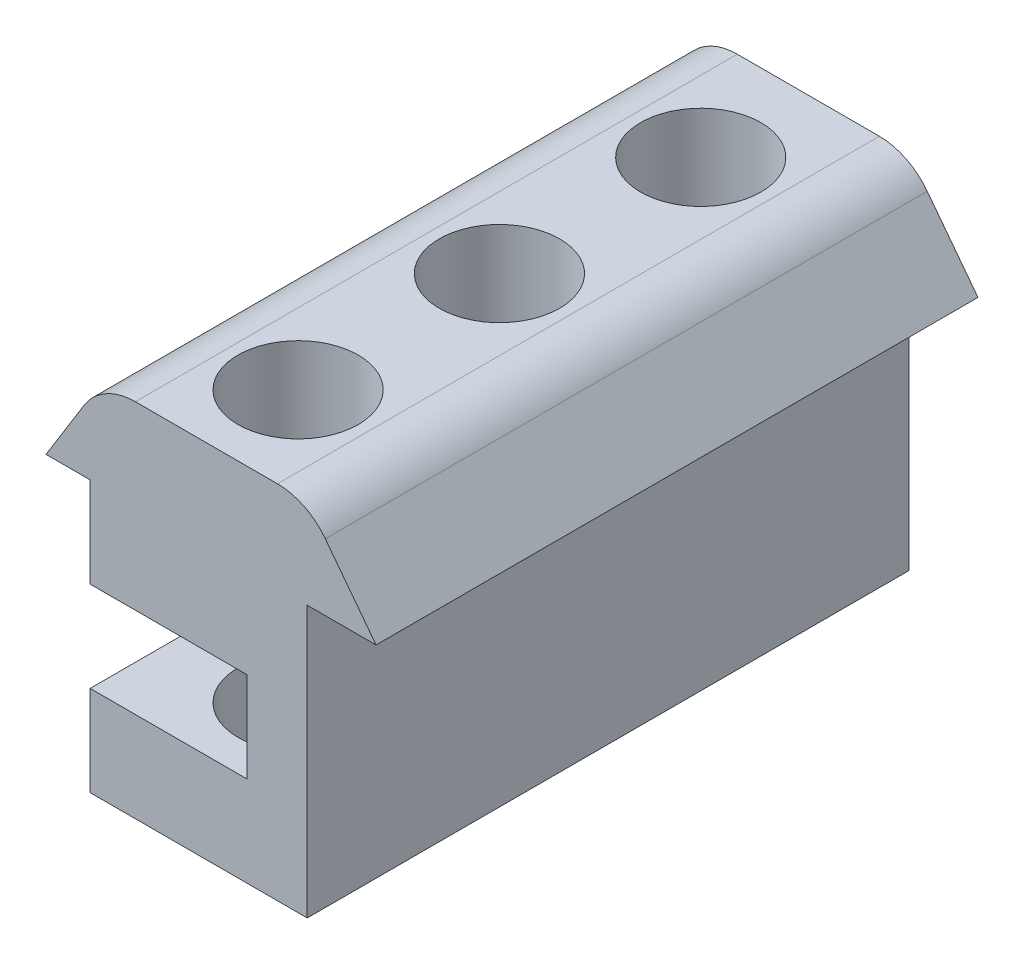
ISO-10303-21;
HEADER;
FILE_DESCRIPTION(('STEP AP214'),'2;1');
FILE_NAME('part.step','',(''),(''),'','','');
FILE_SCHEMA(('AUTOMOTIVE_DESIGN { 1 0 10303 214 1 1 1 1 }'));
ENDSEC;
DATA;
#1=APPLICATION_CONTEXT('core data for automotive mechanical design processes');
#2=APPLICATION_PROTOCOL_DEFINITION('international standard','automotive_design',2000,#1);
#3=PRODUCT_CONTEXT('',#1,'mechanical');
#4=PRODUCT('Part','Part','',(#3));
#5=PRODUCT_RELATED_PRODUCT_CATEGORY('part','',(#4));
#6=PRODUCT_DEFINITION_FORMATION('','',#4);
#7=PRODUCT_DEFINITION_CONTEXT('part definition',#1,'design');
#8=PRODUCT_DEFINITION('design','',#6,#7);
#9=PRODUCT_DEFINITION_SHAPE('','',#8);
#10=(LENGTH_UNIT() NAMED_UNIT(*) SI_UNIT(.MILLI.,.METRE.));
#11=(NAMED_UNIT(*) PLANE_ANGLE_UNIT() SI_UNIT($,.RADIAN.));
#12=(NAMED_UNIT(*) SI_UNIT($,.STERADIAN.) SOLID_ANGLE_UNIT());
#13=UNCERTAINTY_MEASURE_WITH_UNIT(LENGTH_MEASURE(1.E-05),#10,'distance_accuracy_value','');
#14=(GEOMETRIC_REPRESENTATION_CONTEXT(3) GLOBAL_UNCERTAINTY_ASSIGNED_CONTEXT((#13)) GLOBAL_UNIT_ASSIGNED_CONTEXT((#10,
#11,#12)) REPRESENTATION_CONTEXT('',''));
#15=CARTESIAN_POINT('',(0.,0.,0.));
#16=DIRECTION('',(0.,0.,1.));
#17=DIRECTION('',(1.,0.,0.));
#18=AXIS2_PLACEMENT_3D('',#15,#16,#17);
#19=CARTESIAN_POINT('',(1.19634338155823,0.,20.));
#20=DIRECTION('',(1.,0.,0.));
#21=DIRECTION('',(0.,1.,0.));
#22=AXIS2_PLACEMENT_3D('',#19,#20,#21);
#23=PLANE('',#22);
#24=DIRECTION('',(0.,0.,-1.));
#25=VECTOR('',#24,1.);
#26=CARTESIAN_POINT('',(1.19634338155823,-7.5,20.));
#27=LINE('',#26,#25);
#28=CARTESIAN_POINT('',(1.19634338155823,-7.5,15.4780028495127));
#29=VERTEX_POINT('',#28);
#30=CARTESIAN_POINT('',(1.19634338155823,-7.5,11.7392547576253));
#31=VERTEX_POINT('',#30);
#32=EDGE_CURVE('E195',#29,#31,#27,.T.);
#33=ORIENTED_EDGE('',*,*,#32,.F.);
#34=DIRECTION('',(0.,1.,0.));
#35=VECTOR('',#34,1.);
#36=CARTESIAN_POINT('',(1.19634338155823,-16.,15.4780028495127));
#37=LINE('',#36,#35);
#38=CARTESIAN_POINT('',(1.19634338155823,-4.5,15.4780028495127));
#39=VERTEX_POINT('',#38);
#40=EDGE_CURVE('E52',#29,#39,#37,.T.);
#41=ORIENTED_EDGE('',*,*,#40,.T.);
#42=DIRECTION('',(0.,0.,-1.));
#43=VECTOR('',#42,1.);
#44=CARTESIAN_POINT('',(1.19634338155823,-4.5,20.));
#45=LINE('',#44,#43);
#46=CARTESIAN_POINT('',(1.19634338155823,-4.5,11.7392547576253));
#47=VERTEX_POINT('',#46);
#48=EDGE_CURVE('E325',#39,#47,#45,.T.);
#49=ORIENTED_EDGE('',*,*,#48,.T.);
#50=DIRECTION('',(0.,1.,0.));
#51=VECTOR('',#50,1.);
#52=CARTESIAN_POINT('',(1.19634338155823,-16.,11.7392547576253));
#53=LINE('',#52,#51);
#54=EDGE_CURVE('E312',#47,#31,#53,.F.);
#55=ORIENTED_EDGE('',*,*,#54,.T.);
#56=EDGE_LOOP('',(#33,#41,#49,#55));
#57=FACE_BOUND('',#56,.T.);
#58=ADVANCED_FACE('F35',(#57),#23,.F.);
#59=CARTESIAN_POINT('',(1.19634338155823,-7.5,8.78883726240915));
#60=VERTEX_POINT('',#59);
#61=CARTESIAN_POINT('',(1.19634338155823,-7.5,5.05008917052173));
#62=VERTEX_POINT('',#61);
#63=EDGE_CURVE('E200',#60,#62,#27,.T.);
#64=ORIENTED_EDGE('',*,*,#63,.F.);
#65=DIRECTION('',(0.,1.,0.));
#66=VECTOR('',#65,1.);
#67=CARTESIAN_POINT('',(1.19634338155823,-16.,8.78883726240915));
#68=LINE('',#67,#66);
#69=CARTESIAN_POINT('',(1.19634338155823,-4.5,8.78883726240915));
#70=VERTEX_POINT('',#69);
#71=EDGE_CURVE('E60',#60,#70,#68,.T.);
#72=ORIENTED_EDGE('',*,*,#71,.T.);
#73=CARTESIAN_POINT('',(1.19634338155823,-4.5,5.05008917052172));
#74=VERTEX_POINT('',#73);
#75=EDGE_CURVE('E198',#70,#74,#45,.T.);
#76=ORIENTED_EDGE('',*,*,#75,.T.);
#77=DIRECTION('',(0.,1.,0.));
#78=VECTOR('',#77,1.);
#79=CARTESIAN_POINT('',(1.19634338155823,-16.,5.05008917052172));
#80=LINE('',#79,#78);
#81=EDGE_CURVE('E299',#74,#62,#80,.F.);
#82=ORIENTED_EDGE('',*,*,#81,.T.);
#83=EDGE_LOOP('',(#64,#72,#76,#82));
#84=FACE_BOUND('',#83,.T.);
#85=ADVANCED_FACE('F419',(#84),#23,.F.);
#86=CARTESIAN_POINT('',(1.19634338155823,-7.5,2.0996716753056));
#87=VERTEX_POINT('',#86);
#88=CARTESIAN_POINT('',(1.19634338155823,-7.5,0.));
#89=VERTEX_POINT('',#88);
#90=EDGE_CURVE('E197',#87,#89,#27,.T.);
#91=ORIENTED_EDGE('',*,*,#90,.F.);
#92=DIRECTION('',(0.,1.,0.));
#93=VECTOR('',#92,1.);
#94=CARTESIAN_POINT('',(1.19634338155823,-16.,2.0996716753056));
#95=LINE('',#94,#93);
#96=CARTESIAN_POINT('',(1.19634338155823,-4.5,2.0996716753056));
#97=VERTEX_POINT('',#96);
#98=EDGE_CURVE('E296',#87,#97,#95,.T.);
#99=ORIENTED_EDGE('',*,*,#98,.T.);
#100=CARTESIAN_POINT('',(1.19634338155823,-4.5,0.));
#101=VERTEX_POINT('',#100);
#102=EDGE_CURVE('E194',#97,#101,#45,.T.);
#103=ORIENTED_EDGE('',*,*,#102,.T.);
#104=DIRECTION('',(0.,-1.,0.));
#105=VECTOR('',#104,1.);
#106=CARTESIAN_POINT('',(1.19634338155823,0.,0.));
#107=LINE('',#106,#105);
#108=EDGE_CURVE('E240',#101,#89,#107,.T.);
#109=ORIENTED_EDGE('',*,*,#108,.T.);
#110=EDGE_LOOP('',(#91,#99,#103,#109));
#111=FACE_BOUND('',#110,.T.);
#112=ADVANCED_FACE('F411',(#111),#23,.F.);
#113=CARTESIAN_POINT('',(2.20614738938729,-0.500000000000007,20.));
#114=DIRECTION('',(0.,0.,-1.));
#115=DIRECTION('',(-1.,0.,0.));
#116=AXIS2_PLACEMENT_3D('',#113,#114,#115);
#117=CYLINDRICAL_SURFACE('',#116,2.);
#118=CARTESIAN_POINT('',(2.20614738938729,-0.500000000000007,0.));
#119=DIRECTION('',(0.,0.,1.));
#120=DIRECTION('',(1.,0.,0.));
#121=AXIS2_PLACEMENT_3D('',#118,#119,#120);
#122=CIRCLE('',#121,2.);
#123=CARTESIAN_POINT('',(2.20614738938729,1.5,0.));
#124=VERTEX_POINT('',#123);
#125=CARTESIAN_POINT('',(3.79666779093927,0.712536536458551,0.));
#126=VERTEX_POINT('',#125);
#127=EDGE_CURVE('E257',#124,#126,#122,.F.);
#128=ORIENTED_EDGE('',*,*,#127,.F.);
#129=DIRECTION('',(0.,0.,-1.));
#130=VECTOR('',#129,1.);
#131=CARTESIAN_POINT('',(2.20614738938729,1.5,20.));
#132=LINE('',#131,#130);
#133=CARTESIAN_POINT('',(2.20614738938729,1.5,20.));
#134=VERTEX_POINT('',#133);
#135=EDGE_CURVE('E11',#134,#124,#132,.T.);
#136=ORIENTED_EDGE('',*,*,#135,.F.);
#137=CARTESIAN_POINT('',(2.20614738938729,-0.500000000000007,20.));
#138=DIRECTION('',(0.,0.,1.));
#139=DIRECTION('',(1.,0.,0.));
#140=AXIS2_PLACEMENT_3D('',#137,#138,#139);
#141=CIRCLE('',#140,2.);
#142=CARTESIAN_POINT('',(3.79666779093927,0.712536536458551,20.));
#143=VERTEX_POINT('',#142);
#144=EDGE_CURVE('E226',#134,#143,#141,.F.);
#145=ORIENTED_EDGE('',*,*,#144,.T.);
#146=DIRECTION('',(0.,0.,-1.));
#147=VECTOR('',#146,1.);
#148=CARTESIAN_POINT('',(3.79666779093927,0.712536536458551,20.));
#149=LINE('',#148,#147);
#150=EDGE_CURVE('E220',#143,#126,#149,.T.);
#151=ORIENTED_EDGE('',*,*,#150,.T.);
#152=EDGE_LOOP('',(#128,#136,#145,#151));
#153=FACE_BOUND('',#152,.T.);
#154=ADVANCED_FACE('F37',(#153),#117,.T.);
#155=CARTESIAN_POINT('',(0.,1.5,20.));
#156=DIRECTION('',(0.,-1.,0.));
#157=DIRECTION('',(1.,0.,0.));
#158=AXIS2_PLACEMENT_3D('',#155,#156,#157);
#159=PLANE('',#158);
#160=CARTESIAN_POINT('',(-0.154122890134862,1.5,16.9532115971208));
#161=DIRECTION('',(0.,-1.,0.));
#162=DIRECTION('',(1.,0.,0.));
#163=AXIS2_PLACEMENT_3D('',#160,#161,#162);
#164=CIRCLE('',#163,2.);
#165=CARTESIAN_POINT('',(1.84587710986514,1.5,16.9532115971208));
#166=VERTEX_POINT('',#165);
#167=EDGE_CURVE('E318',#166,#166,#164,.T.);
#168=ORIENTED_EDGE('',*,*,#167,.T.);
#169=EDGE_LOOP('',(#168));
#170=FACE_BOUND('',#169,.T.);
#171=CARTESIAN_POINT('',(-0.154122890134862,1.5,10.2640460100172));
#172=DIRECTION('',(0.,-1.,0.));
#173=DIRECTION('',(1.,0.,0.));
#174=AXIS2_PLACEMENT_3D('',#171,#172,#173);
#175=CIRCLE('',#174,2.);
#176=CARTESIAN_POINT('',(1.84587710986514,1.5,10.2640460100172));
#177=VERTEX_POINT('',#176);
#178=EDGE_CURVE('E305',#177,#177,#175,.T.);
#179=ORIENTED_EDGE('',*,*,#178,.T.);
#180=EDGE_LOOP('',(#179));
#181=FACE_BOUND('',#180,.T.);
#182=CARTESIAN_POINT('',(-0.154122890134862,1.5,3.57488042291366));
#183=DIRECTION('',(0.,-1.,0.));
#184=DIRECTION('',(1.,0.,0.));
#185=AXIS2_PLACEMENT_3D('',#182,#183,#184);
#186=CIRCLE('',#185,2.);
#187=CARTESIAN_POINT('',(1.84587710986514,1.5,3.57488042291366));
#188=VERTEX_POINT('',#187);
#189=EDGE_CURVE('E260',#188,#188,#186,.T.);
#190=ORIENTED_EDGE('',*,*,#189,.T.);
#191=EDGE_LOOP('',(#190));
#192=FACE_BOUND('',#191,.T.);
#193=DIRECTION('',(-1.,0.,0.));
#194=VECTOR('',#193,1.);
#195=CARTESIAN_POINT('',(0.,1.5,0.));
#196=LINE('',#195,#194);
#197=CARTESIAN_POINT('',(-2.51439316965702,1.49999999999999,0.));
#198=VERTEX_POINT('',#197);
#199=EDGE_CURVE('E255',#124,#198,#196,.T.);
#200=ORIENTED_EDGE('',*,*,#199,.T.);
#201=DIRECTION('',(0.,0.,-1.));
#202=VECTOR('',#201,1.);
#203=CARTESIAN_POINT('',(-2.51439316965702,1.49999999999999,20.));
#204=LINE('',#203,#202);
#205=CARTESIAN_POINT('',(-2.51439316965702,1.49999999999999,20.));
#206=VERTEX_POINT('',#205);
#207=EDGE_CURVE('E44',#206,#198,#204,.T.);
#208=ORIENTED_EDGE('',*,*,#207,.F.);
#209=DIRECTION('',(-1.,0.,0.));
#210=VECTOR('',#209,1.);
#211=CARTESIAN_POINT('',(0.,1.5,20.));
#212=LINE('',#211,#210);
#213=EDGE_CURVE('E287',#134,#206,#212,.T.);
#214=ORIENTED_EDGE('',*,*,#213,.F.);
#215=ORIENTED_EDGE('',*,*,#135,.T.);
#216=EDGE_LOOP('',(#200,#208,#214,#215));
#217=FACE_BOUND('',#216,.T.);
#218=ADVANCED_FACE('F385',(#170,#181,#192,#217),#159,.F.);
#219=CARTESIAN_POINT('',(-2.51439316965702,-0.500000000000007,20.));
#220=DIRECTION('',(0.,0.,-1.));
#221=DIRECTION('',(-1.,0.,0.));
#222=AXIS2_PLACEMENT_3D('',#219,#220,#221);
#223=CYLINDRICAL_SURFACE('',#222,2.);
#224=CARTESIAN_POINT('',(-2.51439316965702,-0.500000000000007,0.));
#225=DIRECTION('',(0.,0.,1.));
#226=DIRECTION('',(1.,0.,0.));
#227=AXIS2_PLACEMENT_3D('',#224,#225,#226);
#228=CIRCLE('',#227,2.);
#229=CARTESIAN_POINT('',(-4.21575729741239,0.551361072508951,0.));
#230=VERTEX_POINT('',#229);
#231=EDGE_CURVE('E253',#198,#230,#228,.T.);
#232=ORIENTED_EDGE('',*,*,#231,.T.);
#233=DIRECTION('',(0.,0.,-1.));
#234=VECTOR('',#233,1.);
#235=CARTESIAN_POINT('',(-4.21575729741239,0.551361072508951,20.));
#236=LINE('',#235,#234);
#237=CARTESIAN_POINT('',(-4.21575729741239,0.551361072508951,20.));
#238=VERTEX_POINT('',#237);
#239=EDGE_CURVE('E338',#238,#230,#236,.T.);
#240=ORIENTED_EDGE('',*,*,#239,.F.);
#241=CARTESIAN_POINT('',(-2.51439316965702,-0.500000000000007,20.));
#242=DIRECTION('',(0.,0.,1.));
#243=DIRECTION('',(1.,0.,0.));
#244=AXIS2_PLACEMENT_3D('',#241,#242,#243);
#245=CIRCLE('',#244,2.);
#246=EDGE_CURVE('E285',#206,#238,#245,.T.);
#247=ORIENTED_EDGE('',*,*,#246,.F.);
#248=ORIENTED_EDGE('',*,*,#207,.T.);
#249=EDGE_LOOP('',(#232,#240,#247,#248));
#250=FACE_BOUND('',#249,.T.);
#251=ADVANCED_FACE('F390',(#250),#223,.T.);
#252=CARTESIAN_POINT('',(-3.29733632127967,2.03759500662388,20.));
#253=DIRECTION('',(0.850682063877688,-0.52568053625448,0.));
#254=DIRECTION('',(0.52568053625448,0.850682063877688,0.));
#255=AXIS2_PLACEMENT_3D('',#252,#253,#254);
#256=PLANE('',#255);
#257=DIRECTION('',(-0.52568053625448,-0.850682063877688,0.));
#258=VECTOR('',#257,1.);
#259=CARTESIAN_POINT('',(-3.29733632127967,2.03759500662388,0.));
#260=LINE('',#259,#258);
#261=CARTESIAN_POINT('',(-5.48339962165813,-1.5,0.));
#262=VERTEX_POINT('',#261);
#263=EDGE_CURVE('E250',#230,#262,#260,.T.);
#264=ORIENTED_EDGE('',*,*,#263,.T.);
#265=DIRECTION('',(0.,0.,-1.));
#266=VECTOR('',#265,1.);
#267=CARTESIAN_POINT('',(-5.48339962165813,-1.5,20.));
#268=LINE('',#267,#266);
#269=CARTESIAN_POINT('',(-5.48339962165813,-1.5,20.));
#270=VERTEX_POINT('',#269);
#271=EDGE_CURVE('E336',#270,#262,#268,.T.);
#272=ORIENTED_EDGE('',*,*,#271,.F.);
#273=DIRECTION('',(-0.52568053625448,-0.850682063877688,0.));
#274=VECTOR('',#273,1.);
#275=CARTESIAN_POINT('',(-3.29733632127967,2.03759500662388,20.));
#276=LINE('',#275,#274);
#277=EDGE_CURVE('E283',#238,#270,#276,.T.);
#278=ORIENTED_EDGE('',*,*,#277,.F.);
#279=ORIENTED_EDGE('',*,*,#239,.T.);
#280=EDGE_LOOP('',(#264,#272,#278,#279));
#281=FACE_BOUND('',#280,.T.);
#282=ADVANCED_FACE('F395',(#281),#256,.F.);
#283=CARTESIAN_POINT('',(0.,-1.5,20.));
#284=DIRECTION('',(0.,-1.,0.));
#285=DIRECTION('',(0.,0.,-1.));
#286=AXIS2_PLACEMENT_3D('',#283,#284,#285);
#287=PLANE('',#286);
#288=DIRECTION('',(-1.,0.,0.));
#289=VECTOR('',#288,1.);
#290=CARTESIAN_POINT('',(0.,-1.5,0.));
#291=LINE('',#290,#289);
#292=CARTESIAN_POINT('',(-4.01660037834188,-1.5,0.));
#293=VERTEX_POINT('',#292);
#294=EDGE_CURVE('E247',#293,#262,#291,.T.);
#295=ORIENTED_EDGE('',*,*,#294,.F.);
#296=DIRECTION('',(0.,0.,-1.));
#297=VECTOR('',#296,1.);
#298=CARTESIAN_POINT('',(-4.01660037834188,-1.5,20.));
#299=LINE('',#298,#297);
#300=CARTESIAN_POINT('',(-4.01660037834188,-1.5,20.));
#301=VERTEX_POINT('',#300);
#302=EDGE_CURVE('E334',#301,#293,#299,.T.);
#303=ORIENTED_EDGE('',*,*,#302,.F.);
#304=DIRECTION('',(-1.,0.,0.));
#305=VECTOR('',#304,1.);
#306=CARTESIAN_POINT('',(0.,-1.5,20.));
#307=LINE('',#306,#305);
#308=EDGE_CURVE('E280',#301,#270,#307,.T.);
#309=ORIENTED_EDGE('',*,*,#308,.T.);
#310=ORIENTED_EDGE('',*,*,#271,.T.);
#311=EDGE_LOOP('',(#295,#303,#309,#310));
#312=FACE_BOUND('',#311,.T.);
#313=ADVANCED_FACE('F399',(#312),#287,.T.);
#314=CARTESIAN_POINT('',(-4.01660037834188,0.,20.));
#315=DIRECTION('',(1.,0.,0.));
#316=DIRECTION('',(0.,1.,0.));
#317=AXIS2_PLACEMENT_3D('',#314,#315,#316);
#318=PLANE('',#317);
#319=DIRECTION('',(0.,-1.,0.));
#320=VECTOR('',#319,1.);
#321=CARTESIAN_POINT('',(-4.01660037834188,0.,0.));
#322=LINE('',#321,#320);
#323=CARTESIAN_POINT('',(-4.01660037834187,-4.5,0.));
#324=VERTEX_POINT('',#323);
#325=EDGE_CURVE('E245',#293,#324,#322,.T.);
#326=ORIENTED_EDGE('',*,*,#325,.T.);
#327=DIRECTION('',(0.,0.,-1.));
#328=VECTOR('',#327,1.);
#329=CARTESIAN_POINT('',(-4.01660037834187,-4.5,20.));
#330=LINE('',#329,#328);
#331=CARTESIAN_POINT('',(-4.01660037834187,-4.5,20.));
#332=VERTEX_POINT('',#331);
#333=EDGE_CURVE('E330',#332,#324,#330,.T.);
#334=ORIENTED_EDGE('',*,*,#333,.F.);
#335=DIRECTION('',(0.,-1.,0.));
#336=VECTOR('',#335,1.);
#337=CARTESIAN_POINT('',(-4.01660037834188,0.,20.));
#338=LINE('',#337,#336);
#339=EDGE_CURVE('E278',#301,#332,#338,.T.);
#340=ORIENTED_EDGE('',*,*,#339,.F.);
#341=ORIENTED_EDGE('',*,*,#302,.T.);
#342=EDGE_LOOP('',(#326,#334,#340,#341));
#343=FACE_BOUND('',#342,.T.);
#344=ADVANCED_FACE('F404',(#343),#318,.F.);
#345=CARTESIAN_POINT('',(0.,-4.5,20.));
#346=DIRECTION('',(0.,1.,0.));
#347=DIRECTION('',(0.,0.,1.));
#348=AXIS2_PLACEMENT_3D('',#345,#346,#347);
#349=PLANE('',#348);
#350=ORIENTED_EDGE('',*,*,#48,.F.);
#351=CARTESIAN_POINT('',(-0.154122890134862,-4.5,16.9532115971208));
#352=DIRECTION('',(0.,1.,0.));
#353=DIRECTION('',(0.,0.,1.));
#354=AXIS2_PLACEMENT_3D('',#351,#352,#353);
#355=CIRCLE('',#354,2.);
#356=CARTESIAN_POINT('',(1.19634338155823,-4.5,18.4284203447288));
#357=VERTEX_POINT('',#356);
#358=EDGE_CURVE('E321',#39,#357,#355,.T.);
#359=ORIENTED_EDGE('',*,*,#358,.T.);
#360=CARTESIAN_POINT('',(1.19634338155823,-4.5,20.));
#361=VERTEX_POINT('',#360);
#362=EDGE_CURVE('E189',#361,#357,#45,.T.);
#363=ORIENTED_EDGE('',*,*,#362,.F.);
#364=DIRECTION('',(1.,0.,0.));
#365=VECTOR('',#364,1.);
#366=CARTESIAN_POINT('',(0.,-4.5,20.));
#367=LINE('',#366,#365);
#368=EDGE_CURVE('E276',#332,#361,#367,.T.);
#369=ORIENTED_EDGE('',*,*,#368,.F.);
#370=ORIENTED_EDGE('',*,*,#333,.T.);
#371=DIRECTION('',(1.,0.,0.));
#372=VECTOR('',#371,1.);
#373=CARTESIAN_POINT('',(0.,-4.5,0.));
#374=LINE('',#373,#372);
#375=EDGE_CURVE('E242',#324,#101,#374,.T.);
#376=ORIENTED_EDGE('',*,*,#375,.T.);
#377=ORIENTED_EDGE('',*,*,#102,.F.);
#378=CARTESIAN_POINT('',(-0.154122890134862,-4.5,3.57488042291366));
#379=DIRECTION('',(0.,1.,0.));
#380=DIRECTION('',(0.,0.,1.));
#381=AXIS2_PLACEMENT_3D('',#378,#379,#380);
#382=CIRCLE('',#381,2.);
#383=EDGE_CURVE('E293',#97,#74,#382,.T.);
#384=ORIENTED_EDGE('',*,*,#383,.T.);
#385=ORIENTED_EDGE('',*,*,#75,.F.);
#386=CARTESIAN_POINT('',(-0.154122890134862,-4.5,10.2640460100172));
#387=DIRECTION('',(0.,1.,0.));
#388=DIRECTION('',(0.,0.,1.));
#389=AXIS2_PLACEMENT_3D('',#386,#387,#388);
#390=CIRCLE('',#389,2.);
#391=EDGE_CURVE('E308',#70,#47,#390,.T.);
#392=ORIENTED_EDGE('',*,*,#391,.T.);
#393=EDGE_LOOP('',(#350,#359,#363,#369,#370,#376,#377,#384,#385,#392));
#394=FACE_BOUND('',#393,.T.);
#395=ADVANCED_FACE('F328',(#394),#349,.F.);
#396=ORIENTED_EDGE('',*,*,#362,.T.);
#397=DIRECTION('',(0.,1.,0.));
#398=VECTOR('',#397,1.);
#399=CARTESIAN_POINT('',(1.19634338155823,-16.,18.4284203447288));
#400=LINE('',#399,#398);
#401=CARTESIAN_POINT('',(1.19634338155823,-7.5,18.4284203447288));
#402=VERTEX_POINT('',#401);
#403=EDGE_CURVE('E175',#357,#402,#400,.F.);
#404=ORIENTED_EDGE('',*,*,#403,.T.);
#405=CARTESIAN_POINT('',(1.19634338155823,-7.5,20.));
#406=VERTEX_POINT('',#405);
#407=EDGE_CURVE('E186',#406,#402,#27,.T.);
#408=ORIENTED_EDGE('',*,*,#407,.F.);
#409=DIRECTION('',(0.,-1.,0.));
#410=VECTOR('',#409,1.);
#411=CARTESIAN_POINT('',(1.19634338155823,0.,20.));
#412=LINE('',#411,#410);
#413=EDGE_CURVE('E274',#361,#406,#412,.T.);
#414=ORIENTED_EDGE('',*,*,#413,.F.);
#415=EDGE_LOOP('',(#396,#404,#408,#414));
#416=FACE_BOUND('',#415,.T.);
#417=ADVANCED_FACE('F184',(#416),#23,.F.);
#418=CARTESIAN_POINT('',(0.,-7.5,20.));
#419=DIRECTION('',(0.,-1.,0.));
#420=DIRECTION('',(1.,0.,0.));
#421=AXIS2_PLACEMENT_3D('',#418,#419,#420);
#422=PLANE('',#421);
#423=ORIENTED_EDGE('',*,*,#407,.T.);
#424=CARTESIAN_POINT('',(-0.154122890134862,-7.5,16.9532115971208));
#425=DIRECTION('',(0.,-1.,0.));
#426=DIRECTION('',(1.,0.,0.));
#427=AXIS2_PLACEMENT_3D('',#424,#425,#426);
#428=CIRCLE('',#427,2.);
#429=EDGE_CURVE('E171',#402,#29,#428,.T.);
#430=ORIENTED_EDGE('',*,*,#429,.T.);
#431=ORIENTED_EDGE('',*,*,#32,.T.);
#432=CARTESIAN_POINT('',(-0.154122890134862,-7.5,10.2640460100172));
#433=DIRECTION('',(0.,-1.,0.));
#434=DIRECTION('',(1.,0.,0.));
#435=AXIS2_PLACEMENT_3D('',#432,#433,#434);
#436=CIRCLE('',#435,2.);
#437=EDGE_CURVE('E315',#31,#60,#436,.T.);
#438=ORIENTED_EDGE('',*,*,#437,.T.);
#439=ORIENTED_EDGE('',*,*,#63,.T.);
#440=CARTESIAN_POINT('',(-0.154122890134862,-7.5,3.57488042291366));
#441=DIRECTION('',(0.,-1.,0.));
#442=DIRECTION('',(1.,0.,0.));
#443=AXIS2_PLACEMENT_3D('',#440,#441,#442);
#444=CIRCLE('',#443,2.);
#445=EDGE_CURVE('E302',#62,#87,#444,.T.);
#446=ORIENTED_EDGE('',*,*,#445,.T.);
#447=ORIENTED_EDGE('',*,*,#90,.T.);
#448=DIRECTION('',(-1.,0.,0.));
#449=VECTOR('',#448,1.);
#450=CARTESIAN_POINT('',(0.,-7.5,0.));
#451=LINE('',#450,#449);
#452=CARTESIAN_POINT('',(-4.01660037834186,-7.5,0.));
#453=VERTEX_POINT('',#452);
#454=EDGE_CURVE('E238',#89,#453,#451,.T.);
#455=ORIENTED_EDGE('',*,*,#454,.T.);
#456=DIRECTION('',(0.,0.,-1.));
#457=VECTOR('',#456,1.);
#458=CARTESIAN_POINT('',(-4.01660037834186,-7.5,20.));
#459=LINE('',#458,#457);
#460=CARTESIAN_POINT('',(-4.01660037834186,-7.5,20.));
#461=VERTEX_POINT('',#460);
#462=EDGE_CURVE('E202',#461,#453,#459,.T.);
#463=ORIENTED_EDGE('',*,*,#462,.F.);
#464=DIRECTION('',(-1.,0.,0.));
#465=VECTOR('',#464,1.);
#466=CARTESIAN_POINT('',(0.,-7.5,20.));
#467=LINE('',#466,#465);
#468=EDGE_CURVE('E193',#406,#461,#467,.T.);
#469=ORIENTED_EDGE('',*,*,#468,.F.);
#470=EDGE_LOOP('',(#423,#430,#431,#438,#439,#446,#447,#455,#463,#469));
#471=FACE_BOUND('',#470,.T.);
#472=ADVANCED_FACE('F191',(#471),#422,.F.);
#473=CARTESIAN_POINT('',(-4.01660037834187,0.,20.));
#474=DIRECTION('',(1.,0.,0.));
#475=DIRECTION('',(0.,1.,0.));
#476=AXIS2_PLACEMENT_3D('',#473,#474,#475);
#477=PLANE('',#476);
#478=DIRECTION('',(0.,-1.,0.));
#479=VECTOR('',#478,1.);
#480=CARTESIAN_POINT('',(-4.01660037834187,0.,0.));
#481=LINE('',#480,#479);
#482=CARTESIAN_POINT('',(-4.01660037834186,-10.5,0.));
#483=VERTEX_POINT('',#482);
#484=EDGE_CURVE('E236',#453,#483,#481,.T.);
#485=ORIENTED_EDGE('',*,*,#484,.T.);
#486=DIRECTION('',(0.,0.,-1.));
#487=VECTOR('',#486,1.);
#488=CARTESIAN_POINT('',(-4.01660037834186,-10.5,20.));
#489=LINE('',#488,#487);
#490=CARTESIAN_POINT('',(-4.01660037834186,-10.5,20.));
#491=VERTEX_POINT('',#490);
#492=EDGE_CURVE('E207',#491,#483,#489,.T.);
#493=ORIENTED_EDGE('',*,*,#492,.F.);
#494=DIRECTION('',(0.,-1.,0.));
#495=VECTOR('',#494,1.);
#496=CARTESIAN_POINT('',(-4.01660037834187,0.,20.));
#497=LINE('',#496,#495);
#498=EDGE_CURVE('E271',#461,#491,#497,.T.);
#499=ORIENTED_EDGE('',*,*,#498,.F.);
#500=ORIENTED_EDGE('',*,*,#462,.T.);
#501=EDGE_LOOP('',(#485,#493,#499,#500));
#502=FACE_BOUND('',#501,.T.);
#503=ADVANCED_FACE('F354',(#502),#477,.F.);
#504=CARTESIAN_POINT('',(0.,-10.5,20.));
#505=DIRECTION('',(0.,-1.,0.));
#506=DIRECTION('',(0.,0.,-1.));
#507=AXIS2_PLACEMENT_3D('',#504,#505,#506);
#508=PLANE('',#507);
#509=CARTESIAN_POINT('',(-0.154122890134862,-10.5,16.9532115971208));
#510=DIRECTION('',(0.,-1.,0.));
#511=DIRECTION('',(0.,0.,-1.));
#512=AXIS2_PLACEMENT_3D('',#509,#510,#511);
#513=CIRCLE('',#512,2.);
#514=CARTESIAN_POINT('',(-0.154122890134862,-10.5,14.9532115971208));
#515=VERTEX_POINT('',#514);
#516=EDGE_CURVE('E39',#515,#515,#513,.T.);
#517=ORIENTED_EDGE('',*,*,#516,.F.);
#518=EDGE_LOOP('',(#517));
#519=FACE_BOUND('',#518,.T.);
#520=CARTESIAN_POINT('',(-0.154122890134862,-10.5,10.2640460100172));
#521=DIRECTION('',(0.,-1.,0.));
#522=DIRECTION('',(0.,0.,-1.));
#523=AXIS2_PLACEMENT_3D('',#520,#521,#522);
#524=CIRCLE('',#523,2.);
#525=CARTESIAN_POINT('',(-0.154122890134862,-10.5,8.26404601001722));
#526=VERTEX_POINT('',#525);
#527=EDGE_CURVE('E317',#526,#526,#524,.T.);
#528=ORIENTED_EDGE('',*,*,#527,.F.);
#529=EDGE_LOOP('',(#528));
#530=FACE_BOUND('',#529,.T.);
#531=CARTESIAN_POINT('',(-0.154122890134862,-10.5,3.57488042291366));
#532=DIRECTION('',(0.,-1.,0.));
#533=DIRECTION('',(0.,0.,-1.));
#534=AXIS2_PLACEMENT_3D('',#531,#532,#533);
#535=CIRCLE('',#534,2.);
#536=CARTESIAN_POINT('',(-0.154122890134862,-10.5,1.57488042291366));
#537=VERTEX_POINT('',#536);
#538=EDGE_CURVE('E304',#537,#537,#535,.T.);
#539=ORIENTED_EDGE('',*,*,#538,.F.);
#540=EDGE_LOOP('',(#539));
#541=FACE_BOUND('',#540,.T.);
#542=DIRECTION('',(-1.,0.,0.));
#543=VECTOR('',#542,1.);
#544=CARTESIAN_POINT('',(0.,-10.5,0.));
#545=LINE('',#544,#543);
#546=CARTESIAN_POINT('',(3.19634338155823,-10.5,0.));
#547=VERTEX_POINT('',#546);
#548=EDGE_CURVE('E233',#547,#483,#545,.T.);
#549=ORIENTED_EDGE('',*,*,#548,.F.);
#550=DIRECTION('',(0.,0.,-1.));
#551=VECTOR('',#550,1.);
#552=CARTESIAN_POINT('',(3.19634338155823,-10.5,20.));
#553=LINE('',#552,#551);
#554=CARTESIAN_POINT('',(3.19634338155823,-10.5,20.));
#555=VERTEX_POINT('',#554);
#556=EDGE_CURVE('E212',#555,#547,#553,.T.);
#557=ORIENTED_EDGE('',*,*,#556,.F.);
#558=DIRECTION('',(-1.,0.,0.));
#559=VECTOR('',#558,1.);
#560=CARTESIAN_POINT('',(0.,-10.5,20.));
#561=LINE('',#560,#559);
#562=EDGE_CURVE('E268',#555,#491,#561,.T.);
#563=ORIENTED_EDGE('',*,*,#562,.T.);
#564=ORIENTED_EDGE('',*,*,#492,.T.);
#565=EDGE_LOOP('',(#549,#557,#563,#564));
#566=FACE_BOUND('',#565,.T.);
#567=ADVANCED_FACE('F350',(#519,#530,#541,#566),#508,.T.);
#568=CARTESIAN_POINT('',(3.19634338155823,0.,20.));
#569=DIRECTION('',(1.,0.,0.));
#570=DIRECTION('',(0.,1.,0.));
#571=AXIS2_PLACEMENT_3D('',#568,#569,#570);
#572=PLANE('',#571);
#573=DIRECTION('',(0.,-1.,0.));
#574=VECTOR('',#573,1.);
#575=CARTESIAN_POINT('',(3.19634338155823,0.,0.));
#576=LINE('',#575,#574);
#577=CARTESIAN_POINT('',(3.19634338155823,-1.5,0.));
#578=VERTEX_POINT('',#577);
#579=EDGE_CURVE('E230',#578,#547,#576,.T.);
#580=ORIENTED_EDGE('',*,*,#579,.F.);
#581=DIRECTION('',(0.,0.,-1.));
#582=VECTOR('',#581,1.);
#583=CARTESIAN_POINT('',(3.19634338155823,-1.5,20.));
#584=LINE('',#583,#582);
#585=CARTESIAN_POINT('',(3.19634338155823,-1.5,20.));
#586=VERTEX_POINT('',#585);
#587=EDGE_CURVE('E216',#586,#578,#584,.T.);
#588=ORIENTED_EDGE('',*,*,#587,.F.);
#589=DIRECTION('',(0.,-1.,0.));
#590=VECTOR('',#589,1.);
#591=CARTESIAN_POINT('',(3.19634338155823,0.,20.));
#592=LINE('',#591,#590);
#593=EDGE_CURVE('E265',#586,#555,#592,.T.);
#594=ORIENTED_EDGE('',*,*,#593,.T.);
#595=ORIENTED_EDGE('',*,*,#556,.T.);
#596=EDGE_LOOP('',(#580,#588,#594,#595));
#597=FACE_BOUND('',#596,.T.);
#598=ADVANCED_FACE('F353',(#597),#572,.T.);
#599=CARTESIAN_POINT('',(0.,-1.5,20.));
#600=DIRECTION('',(0.,-1.,0.));
#601=DIRECTION('',(0.,0.,-1.));
#602=AXIS2_PLACEMENT_3D('',#599,#600,#601);
#603=PLANE('',#602);
#604=DIRECTION('',(-1.,0.,0.));
#605=VECTOR('',#604,1.);
#606=CARTESIAN_POINT('',(0.,-1.5,0.));
#607=LINE('',#606,#605);
#608=CARTESIAN_POINT('',(5.48339962165813,-1.5,0.));
#609=VERTEX_POINT('',#608);
#610=EDGE_CURVE('E227',#609,#578,#607,.T.);
#611=ORIENTED_EDGE('',*,*,#610,.F.);
#612=DIRECTION('',(0.,0.,-1.));
#613=VECTOR('',#612,1.);
#614=CARTESIAN_POINT('',(5.48339962165813,-1.5,20.));
#615=LINE('',#614,#613);
#616=CARTESIAN_POINT('',(5.48339962165813,-1.5,20.));
#617=VERTEX_POINT('',#616);
#618=EDGE_CURVE('E218',#617,#609,#615,.T.);
#619=ORIENTED_EDGE('',*,*,#618,.F.);
#620=DIRECTION('',(-1.,0.,0.));
#621=VECTOR('',#620,1.);
#622=CARTESIAN_POINT('',(0.,-1.5,20.));
#623=LINE('',#622,#621);
#624=EDGE_CURVE('E262',#617,#586,#623,.T.);
#625=ORIENTED_EDGE('',*,*,#624,.T.);
#626=ORIENTED_EDGE('',*,*,#587,.T.);
#627=EDGE_LOOP('',(#611,#619,#625,#626));
#628=FACE_BOUND('',#627,.T.);
#629=ADVANCED_FACE('F374',(#628),#603,.T.);
#630=CARTESIAN_POINT('',(2.74470306794505,2.09243009292169,20.));
#631=DIRECTION('',(-0.795260200775992,-0.606268268229279,0.));
#632=DIRECTION('',(0.606268268229279,-0.795260200775992,0.));
#633=AXIS2_PLACEMENT_3D('',#630,#631,#632);
#634=PLANE('',#633);
#635=DIRECTION('',(-0.606268268229279,0.795260200775992,0.));
#636=VECTOR('',#635,1.);
#637=CARTESIAN_POINT('',(2.74470306794505,2.09243009292169,0.));
#638=LINE('',#637,#636);
#639=EDGE_CURVE('E223',#609,#126,#638,.T.);
#640=ORIENTED_EDGE('',*,*,#639,.T.);
#641=ORIENTED_EDGE('',*,*,#150,.F.);
#642=DIRECTION('',(-0.606268268229279,0.795260200775992,0.));
#643=VECTOR('',#642,1.);
#644=CARTESIAN_POINT('',(2.74470306794505,2.09243009292169,20.));
#645=LINE('',#644,#643);
#646=EDGE_CURVE('E222',#617,#143,#645,.T.);
#647=ORIENTED_EDGE('',*,*,#646,.F.);
#648=ORIENTED_EDGE('',*,*,#618,.T.);
#649=EDGE_LOOP('',(#640,#641,#647,#648));
#650=FACE_BOUND('',#649,.T.);
#651=ADVANCED_FACE('F378',(#650),#634,.F.);
#652=CARTESIAN_POINT('',(0.,0.,20.));
#653=DIRECTION('',(0.,0.,1.));
#654=DIRECTION('',(1.,0.,0.));
#655=AXIS2_PLACEMENT_3D('',#652,#653,#654);
#656=PLANE('',#655);
#657=ORIENTED_EDGE('',*,*,#144,.F.);
#658=ORIENTED_EDGE('',*,*,#213,.T.);
#659=ORIENTED_EDGE('',*,*,#246,.T.);
#660=ORIENTED_EDGE('',*,*,#277,.T.);
#661=ORIENTED_EDGE('',*,*,#308,.F.);
#662=ORIENTED_EDGE('',*,*,#339,.T.);
#663=ORIENTED_EDGE('',*,*,#368,.T.);
#664=ORIENTED_EDGE('',*,*,#413,.T.);
#665=ORIENTED_EDGE('',*,*,#468,.T.);
#666=ORIENTED_EDGE('',*,*,#498,.T.);
#667=ORIENTED_EDGE('',*,*,#562,.F.);
#668=ORIENTED_EDGE('',*,*,#593,.F.);
#669=ORIENTED_EDGE('',*,*,#624,.F.);
#670=ORIENTED_EDGE('',*,*,#646,.T.);
#671=EDGE_LOOP('',(#657,#658,#659,#660,#661,#662,#663,#664,#665,#666,#667,#668,#669,#670));
#672=FACE_BOUND('',#671,.T.);
#673=ADVANCED_FACE('F372',(#672),#656,.T.);
#674=CARTESIAN_POINT('',(0.,0.,0.));
#675=DIRECTION('',(0.,0.,1.));
#676=DIRECTION('',(1.,0.,0.));
#677=AXIS2_PLACEMENT_3D('',#674,#675,#676);
#678=PLANE('',#677);
#679=ORIENTED_EDGE('',*,*,#127,.T.);
#680=ORIENTED_EDGE('',*,*,#639,.F.);
#681=ORIENTED_EDGE('',*,*,#610,.T.);
#682=ORIENTED_EDGE('',*,*,#579,.T.);
#683=ORIENTED_EDGE('',*,*,#548,.T.);
#684=ORIENTED_EDGE('',*,*,#484,.F.);
#685=ORIENTED_EDGE('',*,*,#454,.F.);
#686=ORIENTED_EDGE('',*,*,#108,.F.);
#687=ORIENTED_EDGE('',*,*,#375,.F.);
#688=ORIENTED_EDGE('',*,*,#325,.F.);
#689=ORIENTED_EDGE('',*,*,#294,.T.);
#690=ORIENTED_EDGE('',*,*,#263,.F.);
#691=ORIENTED_EDGE('',*,*,#231,.F.);
#692=ORIENTED_EDGE('',*,*,#199,.F.);
#693=EDGE_LOOP('',(#679,#680,#681,#682,#683,#684,#685,#686,#687,#688,#689,#690,#691,#692));
#694=FACE_BOUND('',#693,.T.);
#695=ADVANCED_FACE('F364',(#694),#678,.F.);
#696=CARTESIAN_POINT('',(-0.154122890134862,-16.,3.57488042291366));
#697=DIRECTION('',(0.,1.,0.));
#698=DIRECTION('',(0.,0.,1.));
#699=AXIS2_PLACEMENT_3D('',#696,#697,#698);
#700=CYLINDRICAL_SURFACE('',#699,2.);
#701=ORIENTED_EDGE('',*,*,#98,.F.);
#702=ORIENTED_EDGE('',*,*,#445,.F.);
#703=ORIENTED_EDGE('',*,*,#81,.F.);
#704=ORIENTED_EDGE('',*,*,#383,.F.);
#705=EDGE_LOOP('',(#701,#702,#703,#704));
#706=FACE_BOUND('',#705,.T.);
#707=ORIENTED_EDGE('',*,*,#538,.T.);
#708=EDGE_LOOP('',(#707));
#709=FACE_BOUND('',#708,.T.);
#710=ORIENTED_EDGE('',*,*,#189,.F.);
#711=EDGE_LOOP('',(#710));
#712=FACE_BOUND('',#711,.T.);
#713=ADVANCED_FACE('F414',(#706,#709,#712),#700,.F.);
#714=CARTESIAN_POINT('',(-0.154122890134862,-16.,10.2640460100172));
#715=DIRECTION('',(0.,1.,0.));
#716=DIRECTION('',(0.,0.,1.));
#717=AXIS2_PLACEMENT_3D('',#714,#715,#716);
#718=CYLINDRICAL_SURFACE('',#717,2.);
#719=ORIENTED_EDGE('',*,*,#71,.F.);
#720=ORIENTED_EDGE('',*,*,#437,.F.);
#721=ORIENTED_EDGE('',*,*,#54,.F.);
#722=ORIENTED_EDGE('',*,*,#391,.F.);
#723=EDGE_LOOP('',(#719,#720,#721,#722));
#724=FACE_BOUND('',#723,.T.);
#725=ORIENTED_EDGE('',*,*,#527,.T.);
#726=EDGE_LOOP('',(#725));
#727=FACE_BOUND('',#726,.T.);
#728=ORIENTED_EDGE('',*,*,#178,.F.);
#729=EDGE_LOOP('',(#728));
#730=FACE_BOUND('',#729,.T.);
#731=ADVANCED_FACE('F347',(#724,#727,#730),#718,.F.);
#732=CARTESIAN_POINT('',(-0.154122890134862,-16.,16.9532115971208));
#733=DIRECTION('',(0.,1.,0.));
#734=DIRECTION('',(0.,0.,1.));
#735=AXIS2_PLACEMENT_3D('',#732,#733,#734);
#736=CYLINDRICAL_SURFACE('',#735,2.);
#737=ORIENTED_EDGE('',*,*,#40,.F.);
#738=ORIENTED_EDGE('',*,*,#429,.F.);
#739=ORIENTED_EDGE('',*,*,#403,.F.);
#740=ORIENTED_EDGE('',*,*,#358,.F.);
#741=EDGE_LOOP('',(#737,#738,#739,#740));
#742=FACE_BOUND('',#741,.T.);
#743=ORIENTED_EDGE('',*,*,#516,.T.);
#744=EDGE_LOOP('',(#743));
#745=FACE_BOUND('',#744,.T.);
#746=ORIENTED_EDGE('',*,*,#167,.F.);
#747=EDGE_LOOP('',(#746));
#748=FACE_BOUND('',#747,.T.);
#749=ADVANCED_FACE('F173',(#742,#745,#748),#736,.F.);
#750=CLOSED_SHELL('',(#58,#85,#112,#154,#218,#251,#282,#313,#344,#395,#417,#472,#503,#567,#598,
#629,#651,#673,#695,#713,#731,#749));
#751=MANIFOLD_SOLID_BREP('B2',#750);
#752=ADVANCED_BREP_SHAPE_REPRESENTATION('',(#18,#751),#14);
#753=SHAPE_DEFINITION_REPRESENTATION(#9,#752);
ENDSEC;
END-ISO-10303-21;
